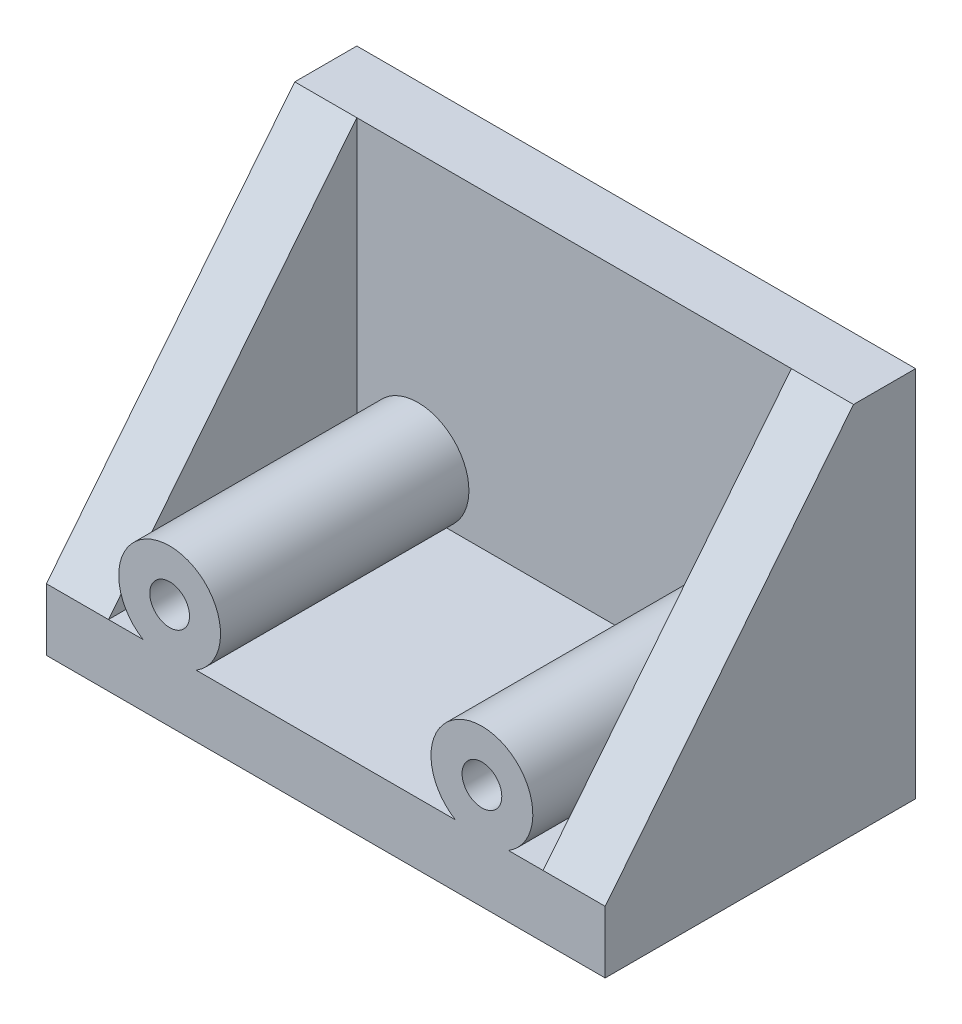
ISO-10303-21;
HEADER;
FILE_DESCRIPTION(('STEP AP214'),'2;1');
FILE_NAME('part.step','',(''),(''),'','','');
FILE_SCHEMA(('AUTOMOTIVE_DESIGN { 1 0 10303 214 1 1 1 1 }'));
ENDSEC;
DATA;
#1=APPLICATION_CONTEXT('core data for automotive mechanical design processes');
#2=APPLICATION_PROTOCOL_DEFINITION('international standard','automotive_design',2000,#1);
#3=PRODUCT_CONTEXT('',#1,'mechanical');
#4=PRODUCT('Part','Part','',(#3));
#5=PRODUCT_RELATED_PRODUCT_CATEGORY('part','',(#4));
#6=PRODUCT_DEFINITION_FORMATION('','',#4);
#7=PRODUCT_DEFINITION_CONTEXT('part definition',#1,'design');
#8=PRODUCT_DEFINITION('design','',#6,#7);
#9=PRODUCT_DEFINITION_SHAPE('','',#8);
#10=(LENGTH_UNIT() NAMED_UNIT(*) SI_UNIT(.MILLI.,.METRE.));
#11=(NAMED_UNIT(*) PLANE_ANGLE_UNIT() SI_UNIT($,.RADIAN.));
#12=(NAMED_UNIT(*) SI_UNIT($,.STERADIAN.) SOLID_ANGLE_UNIT());
#13=UNCERTAINTY_MEASURE_WITH_UNIT(LENGTH_MEASURE(1.E-05),#10,'distance_accuracy_value','');
#14=(GEOMETRIC_REPRESENTATION_CONTEXT(3) GLOBAL_UNCERTAINTY_ASSIGNED_CONTEXT((#13)) GLOBAL_UNIT_ASSIGNED_CONTEXT((#10,
#11,#12)) REPRESENTATION_CONTEXT('',''));
#15=CARTESIAN_POINT('',(0.,0.,0.));
#16=DIRECTION('',(0.,0.,1.));
#17=DIRECTION('',(1.,0.,0.));
#18=AXIS2_PLACEMENT_3D('',#15,#16,#17);
#19=CARTESIAN_POINT('',(0.,-40.,0.));
#20=DIRECTION('',(0.,1.,0.));
#21=DIRECTION('',(0.,0.,1.));
#22=AXIS2_PLACEMENT_3D('',#19,#20,#21);
#23=PLANE('',#22);
#24=DIRECTION('',(0.,0.,-1.));
#25=VECTOR('',#24,1.);
#26=CARTESIAN_POINT('',(58.837662601625,-40.,144.721359549996));
#27=LINE('',#26,#25);
#28=CARTESIAN_POINT('',(58.837662601625,-40.,100.));
#29=VERTEX_POINT('',#28);
#30=CARTESIAN_POINT('',(58.837662601625,-40.,20.));
#31=VERTEX_POINT('',#30);
#32=EDGE_CURVE('E120',#29,#31,#27,.T.);
#33=ORIENTED_EDGE('',*,*,#32,.F.);
#34=DIRECTION('',(-1.,0.,0.));
#35=VECTOR('',#34,1.);
#36=CARTESIAN_POINT('',(-90.,-40.,100.));
#37=LINE('',#36,#35);
#38=CARTESIAN_POINT('',(70.,-40.,100.));
#39=VERTEX_POINT('',#38);
#40=EDGE_CURVE('E172',#39,#29,#37,.T.);
#41=ORIENTED_EDGE('',*,*,#40,.F.);
#42=DIRECTION('',(0.,0.,-1.));
#43=VECTOR('',#42,1.);
#44=CARTESIAN_POINT('',(70.,-40.,100.));
#45=LINE('',#44,#43);
#46=CARTESIAN_POINT('',(70.,-40.,20.));
#47=VERTEX_POINT('',#46);
#48=EDGE_CURVE('E142',#39,#47,#45,.T.);
#49=ORIENTED_EDGE('',*,*,#48,.T.);
#50=DIRECTION('',(-1.,0.,0.));
#51=VECTOR('',#50,1.);
#52=CARTESIAN_POINT('',(0.,-40.,20.));
#53=LINE('',#52,#51);
#54=EDGE_CURVE('E135',#47,#31,#53,.T.);
#55=ORIENTED_EDGE('',*,*,#54,.T.);
#56=EDGE_LOOP('',(#33,#41,#49,#55));
#57=FACE_BOUND('',#56,.T.);
#58=ADVANCED_FACE('F33',(#57),#23,.T.);
#59=DIRECTION('',(0.,0.,-1.));
#60=VECTOR('',#59,1.);
#61=CARTESIAN_POINT('',(41.7543373983749,-40.,144.721359549996));
#62=LINE('',#61,#60);
#63=CARTESIAN_POINT('',(41.7543373983749,-40.,100.));
#64=VERTEX_POINT('',#63);
#65=CARTESIAN_POINT('',(41.7543373983749,-40.,20.));
#66=VERTEX_POINT('',#65);
#67=EDGE_CURVE('E48',#64,#66,#62,.T.);
#68=ORIENTED_EDGE('',*,*,#67,.T.);
#69=CARTESIAN_POINT('',(-41.7543373983749,-40.,20.));
#70=VERTEX_POINT('',#69);
#71=EDGE_CURVE('E137',#66,#70,#53,.T.);
#72=ORIENTED_EDGE('',*,*,#71,.T.);
#73=DIRECTION('',(0.,0.,-1.));
#74=VECTOR('',#73,1.);
#75=CARTESIAN_POINT('',(-41.7543373983749,-40.,144.721359549996));
#76=LINE('',#75,#74);
#77=CARTESIAN_POINT('',(-41.7543373983749,-40.,100.));
#78=VERTEX_POINT('',#77);
#79=EDGE_CURVE('E199',#78,#70,#76,.T.);
#80=ORIENTED_EDGE('',*,*,#79,.F.);
#81=EDGE_CURVE('E173',#64,#78,#37,.T.);
#82=ORIENTED_EDGE('',*,*,#81,.F.);
#83=EDGE_LOOP('',(#68,#72,#80,#82));
#84=FACE_BOUND('',#83,.T.);
#85=ADVANCED_FACE('F231',(#84),#23,.T.);
#86=CARTESIAN_POINT('',(-58.837662601625,-40.,100.));
#87=VERTEX_POINT('',#86);
#88=CARTESIAN_POINT('',(-70.,-40.,100.));
#89=VERTEX_POINT('',#88);
#90=EDGE_CURVE('E168',#87,#89,#37,.T.);
#91=ORIENTED_EDGE('',*,*,#90,.F.);
#92=DIRECTION('',(0.,0.,-1.));
#93=VECTOR('',#92,1.);
#94=CARTESIAN_POINT('',(-58.837662601625,-40.,144.721359549996));
#95=LINE('',#94,#93);
#96=CARTESIAN_POINT('',(-58.837662601625,-40.,20.));
#97=VERTEX_POINT('',#96);
#98=EDGE_CURVE('E189',#87,#97,#95,.T.);
#99=ORIENTED_EDGE('',*,*,#98,.T.);
#100=CARTESIAN_POINT('',(-70.,-40.,20.));
#101=VERTEX_POINT('',#100);
#102=EDGE_CURVE('E145',#97,#101,#53,.T.);
#103=ORIENTED_EDGE('',*,*,#102,.T.);
#104=DIRECTION('',(0.,0.,-1.));
#105=VECTOR('',#104,1.);
#106=CARTESIAN_POINT('',(-70.,-40.,100.));
#107=LINE('',#106,#105);
#108=EDGE_CURVE('E184',#89,#101,#107,.T.);
#109=ORIENTED_EDGE('',*,*,#108,.F.);
#110=EDGE_LOOP('',(#91,#99,#103,#109));
#111=FACE_BOUND('',#110,.T.);
#112=ADVANCED_FACE('F229',(#111),#23,.T.);
#113=CARTESIAN_POINT('',(0.,0.,20.));
#114=DIRECTION('',(0.,0.,1.));
#115=DIRECTION('',(1.,0.,0.));
#116=AXIS2_PLACEMENT_3D('',#113,#114,#115);
#117=PLANE('',#116);
#118=CARTESIAN_POINT('',(50.296,-26.,20.));
#119=DIRECTION('',(0.,0.,-1.));
#120=DIRECTION('',(-1.,0.,0.));
#121=AXIS2_PLACEMENT_3D('',#118,#119,#120);
#122=CIRCLE('',#121,16.4);
#123=EDGE_CURVE('E123',#66,#31,#122,.T.);
#124=ORIENTED_EDGE('',*,*,#123,.T.);
#125=ORIENTED_EDGE('',*,*,#54,.F.);
#126=DIRECTION('',(0.,1.,0.));
#127=VECTOR('',#126,1.);
#128=CARTESIAN_POINT('',(70.,-40.,20.));
#129=LINE('',#128,#127);
#130=CARTESIAN_POINT('',(70.,60.,20.));
#131=VERTEX_POINT('',#130);
#132=EDGE_CURVE('E169',#47,#131,#129,.T.);
#133=ORIENTED_EDGE('',*,*,#132,.T.);
#134=DIRECTION('',(-1.,0.,0.));
#135=VECTOR('',#134,1.);
#136=CARTESIAN_POINT('',(-90.,60.,20.));
#137=LINE('',#136,#135);
#138=CARTESIAN_POINT('',(-70.,60.,20.));
#139=VERTEX_POINT('',#138);
#140=EDGE_CURVE('E257',#131,#139,#137,.T.);
#141=ORIENTED_EDGE('',*,*,#140,.T.);
#142=DIRECTION('',(0.,1.,0.));
#143=VECTOR('',#142,1.);
#144=CARTESIAN_POINT('',(-70.,-40.,20.));
#145=LINE('',#144,#143);
#146=EDGE_CURVE('E191',#101,#139,#145,.T.);
#147=ORIENTED_EDGE('',*,*,#146,.F.);
#148=ORIENTED_EDGE('',*,*,#102,.F.);
#149=CARTESIAN_POINT('',(-50.296,-26.,20.));
#150=DIRECTION('',(0.,0.,1.));
#151=DIRECTION('',(1.,0.,0.));
#152=AXIS2_PLACEMENT_3D('',#149,#150,#151);
#153=CIRCLE('',#152,16.4);
#154=EDGE_CURVE('E202',#70,#97,#153,.T.);
#155=ORIENTED_EDGE('',*,*,#154,.F.);
#156=ORIENTED_EDGE('',*,*,#71,.F.);
#157=EDGE_LOOP('',(#124,#125,#133,#141,#147,#148,#155,#156));
#158=FACE_BOUND('',#157,.T.);
#159=ADVANCED_FACE('F133',(#158),#117,.T.);
#160=CARTESIAN_POINT('',(90.,60.,20.));
#161=DIRECTION('',(-1.,0.,0.));
#162=DIRECTION('',(0.,0.,1.));
#163=AXIS2_PLACEMENT_3D('',#160,#161,#162);
#164=PLANE('',#163);
#165=DIRECTION('',(0.,0.,-1.));
#166=VECTOR('',#165,1.);
#167=CARTESIAN_POINT('',(90.,60.,20.));
#168=LINE('',#167,#166);
#169=CARTESIAN_POINT('',(90.,60.,20.));
#170=VERTEX_POINT('',#169);
#171=CARTESIAN_POINT('',(90.,60.,0.));
#172=VERTEX_POINT('',#171);
#173=EDGE_CURVE('E41',#170,#172,#168,.T.);
#174=ORIENTED_EDGE('',*,*,#173,.F.);
#175=DIRECTION('',(0.,-0.78086880944303,0.624695047554424));
#176=VECTOR('',#175,1.);
#177=CARTESIAN_POINT('',(90.,60.,20.));
#178=LINE('',#177,#176);
#179=CARTESIAN_POINT('',(90.,-40.,100.));
#180=VERTEX_POINT('',#179);
#181=EDGE_CURVE('E174',#170,#180,#178,.T.);
#182=ORIENTED_EDGE('',*,*,#181,.T.);
#183=DIRECTION('',(0.,-1.,0.));
#184=VECTOR('',#183,1.);
#185=CARTESIAN_POINT('',(90.,-40.,100.));
#186=LINE('',#185,#184);
#187=CARTESIAN_POINT('',(90.,-60.,100.));
#188=VERTEX_POINT('',#187);
#189=EDGE_CURVE('E157',#180,#188,#186,.T.);
#190=ORIENTED_EDGE('',*,*,#189,.T.);
#191=DIRECTION('',(0.,0.,-1.));
#192=VECTOR('',#191,1.);
#193=CARTESIAN_POINT('',(90.,-60.,20.));
#194=LINE('',#193,#192);
#195=CARTESIAN_POINT('',(90.,-60.,0.));
#196=VERTEX_POINT('',#195);
#197=EDGE_CURVE('E265',#188,#196,#194,.T.);
#198=ORIENTED_EDGE('',*,*,#197,.T.);
#199=DIRECTION('',(0.,1.,0.));
#200=VECTOR('',#199,1.);
#201=CARTESIAN_POINT('',(90.,60.,0.));
#202=LINE('',#201,#200);
#203=EDGE_CURVE('E143',#196,#172,#202,.T.);
#204=ORIENTED_EDGE('',*,*,#203,.T.);
#205=EDGE_LOOP('',(#174,#182,#190,#198,#204));
#206=FACE_BOUND('',#205,.T.);
#207=ADVANCED_FACE('F35',(#206),#164,.F.);
#208=CARTESIAN_POINT('',(-90.,60.,20.));
#209=DIRECTION('',(0.,-1.,0.));
#210=DIRECTION('',(0.,0.,-1.));
#211=AXIS2_PLACEMENT_3D('',#208,#209,#210);
#212=PLANE('',#211);
#213=DIRECTION('',(-1.,0.,0.));
#214=VECTOR('',#213,1.);
#215=CARTESIAN_POINT('',(-90.,60.,0.));
#216=LINE('',#215,#214);
#217=CARTESIAN_POINT('',(-90.,60.,0.));
#218=VERTEX_POINT('',#217);
#219=EDGE_CURVE('E146',#172,#218,#216,.T.);
#220=ORIENTED_EDGE('',*,*,#219,.T.);
#221=DIRECTION('',(0.,0.,-1.));
#222=VECTOR('',#221,1.);
#223=CARTESIAN_POINT('',(-90.,60.,20.));
#224=LINE('',#223,#222);
#225=CARTESIAN_POINT('',(-90.,60.,20.));
#226=VERTEX_POINT('',#225);
#227=EDGE_CURVE('E276',#226,#218,#224,.T.);
#228=ORIENTED_EDGE('',*,*,#227,.F.);
#229=DIRECTION('',(-1.,0.,0.));
#230=VECTOR('',#229,1.);
#231=CARTESIAN_POINT('',(-70.,60.,20.));
#232=LINE('',#231,#230);
#233=EDGE_CURVE('E182',#139,#226,#232,.T.);
#234=ORIENTED_EDGE('',*,*,#233,.F.);
#235=ORIENTED_EDGE('',*,*,#140,.F.);
#236=EDGE_CURVE('E251',#170,#131,#137,.T.);
#237=ORIENTED_EDGE('',*,*,#236,.F.);
#238=ORIENTED_EDGE('',*,*,#173,.T.);
#239=EDGE_LOOP('',(#220,#228,#234,#235,#237,#238));
#240=FACE_BOUND('',#239,.T.);
#241=ADVANCED_FACE('F260',(#240),#212,.F.);
#242=CARTESIAN_POINT('',(-90.,60.,20.));
#243=DIRECTION('',(1.,0.,0.));
#244=DIRECTION('',(0.,1.,0.));
#245=AXIS2_PLACEMENT_3D('',#242,#243,#244);
#246=PLANE('',#245);
#247=DIRECTION('',(0.,-1.,0.));
#248=VECTOR('',#247,1.);
#249=CARTESIAN_POINT('',(-90.,60.,0.));
#250=LINE('',#249,#248);
#251=CARTESIAN_POINT('',(-90.,-60.,0.));
#252=VERTEX_POINT('',#251);
#253=EDGE_CURVE('E266',#218,#252,#250,.T.);
#254=ORIENTED_EDGE('',*,*,#253,.T.);
#255=DIRECTION('',(0.,0.,-1.));
#256=VECTOR('',#255,1.);
#257=CARTESIAN_POINT('',(-90.,-60.,20.));
#258=LINE('',#257,#256);
#259=CARTESIAN_POINT('',(-90.,-60.,100.));
#260=VERTEX_POINT('',#259);
#261=EDGE_CURVE('E273',#260,#252,#258,.T.);
#262=ORIENTED_EDGE('',*,*,#261,.F.);
#263=DIRECTION('',(0.,-1.,0.));
#264=VECTOR('',#263,1.);
#265=CARTESIAN_POINT('',(-90.,-40.,100.));
#266=LINE('',#265,#264);
#267=CARTESIAN_POINT('',(-90.,-40.,100.));
#268=VERTEX_POINT('',#267);
#269=EDGE_CURVE('E150',#268,#260,#266,.T.);
#270=ORIENTED_EDGE('',*,*,#269,.F.);
#271=DIRECTION('',(0.,-0.78086880944303,0.624695047554424));
#272=VECTOR('',#271,1.);
#273=CARTESIAN_POINT('',(-90.,60.,20.));
#274=LINE('',#273,#272);
#275=EDGE_CURVE('E186',#226,#268,#274,.T.);
#276=ORIENTED_EDGE('',*,*,#275,.F.);
#277=ORIENTED_EDGE('',*,*,#227,.T.);
#278=EDGE_LOOP('',(#254,#262,#270,#276,#277));
#279=FACE_BOUND('',#278,.T.);
#280=ADVANCED_FACE('F286',(#279),#246,.F.);
#281=CARTESIAN_POINT('',(-90.,-60.,20.));
#282=DIRECTION('',(0.,1.,0.));
#283=DIRECTION('',(0.,0.,1.));
#284=AXIS2_PLACEMENT_3D('',#281,#282,#283);
#285=PLANE('',#284);
#286=DIRECTION('',(1.,0.,0.));
#287=VECTOR('',#286,1.);
#288=CARTESIAN_POINT('',(-90.,-60.,0.));
#289=LINE('',#288,#287);
#290=EDGE_CURVE('E264',#252,#196,#289,.T.);
#291=ORIENTED_EDGE('',*,*,#290,.T.);
#292=ORIENTED_EDGE('',*,*,#197,.F.);
#293=DIRECTION('',(-1.,0.,0.));
#294=VECTOR('',#293,1.);
#295=CARTESIAN_POINT('',(-90.,-60.,100.));
#296=LINE('',#295,#294);
#297=EDGE_CURVE('E166',#188,#260,#296,.T.);
#298=ORIENTED_EDGE('',*,*,#297,.T.);
#299=ORIENTED_EDGE('',*,*,#261,.T.);
#300=EDGE_LOOP('',(#291,#292,#298,#299));
#301=FACE_BOUND('',#300,.T.);
#302=ADVANCED_FACE('F289',(#301),#285,.F.);
#303=CARTESIAN_POINT('',(0.,0.,0.));
#304=DIRECTION('',(0.,0.,1.));
#305=DIRECTION('',(1.,0.,0.));
#306=AXIS2_PLACEMENT_3D('',#303,#304,#305);
#307=PLANE('',#306);
#308=ORIENTED_EDGE('',*,*,#219,.F.);
#309=ORIENTED_EDGE('',*,*,#203,.F.);
#310=ORIENTED_EDGE('',*,*,#290,.F.);
#311=ORIENTED_EDGE('',*,*,#253,.F.);
#312=EDGE_LOOP('',(#308,#309,#310,#311));
#313=FACE_BOUND('',#312,.T.);
#314=ADVANCED_FACE('F284',(#313),#307,.F.);
#315=CARTESIAN_POINT('',(-90.,-40.,100.));
#316=DIRECTION('',(0.,0.,1.));
#317=DIRECTION('',(1.,0.,0.));
#318=AXIS2_PLACEMENT_3D('',#315,#316,#317);
#319=PLANE('',#318);
#320=ORIENTED_EDGE('',*,*,#297,.F.);
#321=ORIENTED_EDGE('',*,*,#189,.F.);
#322=EDGE_CURVE('E164',#180,#39,#37,.T.);
#323=ORIENTED_EDGE('',*,*,#322,.T.);
#324=ORIENTED_EDGE('',*,*,#40,.T.);
#325=CARTESIAN_POINT('',(50.296,-26.,100.));
#326=DIRECTION('',(0.,0.,1.));
#327=DIRECTION('',(1.,0.,0.));
#328=AXIS2_PLACEMENT_3D('',#325,#326,#327);
#329=CIRCLE('',#328,16.4);
#330=EDGE_CURVE('E124',#64,#29,#329,.F.);
#331=ORIENTED_EDGE('',*,*,#330,.F.);
#332=ORIENTED_EDGE('',*,*,#81,.T.);
#333=CARTESIAN_POINT('',(-50.296,-26.,100.));
#334=DIRECTION('',(0.,0.,1.));
#335=DIRECTION('',(1.,0.,0.));
#336=AXIS2_PLACEMENT_3D('',#333,#334,#335);
#337=CIRCLE('',#336,16.4);
#338=EDGE_CURVE('E56',#78,#87,#337,.T.);
#339=ORIENTED_EDGE('',*,*,#338,.T.);
#340=ORIENTED_EDGE('',*,*,#90,.T.);
#341=DIRECTION('',(-1.,0.,0.));
#342=VECTOR('',#341,1.);
#343=CARTESIAN_POINT('',(-70.,-40.,100.));
#344=LINE('',#343,#342);
#345=EDGE_CURVE('E177',#89,#268,#344,.T.);
#346=ORIENTED_EDGE('',*,*,#345,.T.);
#347=ORIENTED_EDGE('',*,*,#269,.T.);
#348=EDGE_LOOP('',(#320,#321,#323,#324,#331,#332,#339,#340,#346,#347));
#349=FACE_BOUND('',#348,.T.);
#350=CARTESIAN_POINT('',(-50.296,-26.,100.));
#351=DIRECTION('',(0.,0.,1.));
#352=DIRECTION('',(1.,0.,0.));
#353=AXIS2_PLACEMENT_3D('',#350,#351,#352);
#354=CIRCLE('',#353,6.40000000000001);
#355=CARTESIAN_POINT('',(-43.896,-26.,100.));
#356=VERTEX_POINT('',#355);
#357=EDGE_CURVE('E195',#356,#356,#354,.T.);
#358=ORIENTED_EDGE('',*,*,#357,.F.);
#359=EDGE_LOOP('',(#358));
#360=FACE_BOUND('',#359,.T.);
#361=CARTESIAN_POINT('',(50.296,-26.,100.));
#362=DIRECTION('',(0.,0.,1.));
#363=DIRECTION('',(1.,0.,0.));
#364=AXIS2_PLACEMENT_3D('',#361,#362,#363);
#365=CIRCLE('',#364,6.40000000000001);
#366=CARTESIAN_POINT('',(56.696,-26.,100.));
#367=VERTEX_POINT('',#366);
#368=EDGE_CURVE('E138',#367,#367,#365,.F.);
#369=ORIENTED_EDGE('',*,*,#368,.T.);
#370=EDGE_LOOP('',(#369));
#371=FACE_BOUND('',#370,.T.);
#372=ADVANCED_FACE('F242',(#349,#360,#371),#319,.T.);
#373=CARTESIAN_POINT('',(70.,60.,20.));
#374=DIRECTION('',(0.,0.624695047554424,0.78086880944303));
#375=DIRECTION('',(0.,-0.78086880944303,0.624695047554424));
#376=AXIS2_PLACEMENT_3D('',#373,#374,#375);
#377=PLANE('',#376);
#378=ORIENTED_EDGE('',*,*,#181,.F.);
#379=ORIENTED_EDGE('',*,*,#236,.T.);
#380=DIRECTION('',(0.,-0.78086880944303,0.624695047554424));
#381=VECTOR('',#380,1.);
#382=CARTESIAN_POINT('',(70.,60.,20.));
#383=LINE('',#382,#381);
#384=EDGE_CURVE('E176',#131,#39,#383,.T.);
#385=ORIENTED_EDGE('',*,*,#384,.T.);
#386=ORIENTED_EDGE('',*,*,#322,.F.);
#387=EDGE_LOOP('',(#378,#379,#385,#386));
#388=FACE_BOUND('',#387,.T.);
#389=ADVANCED_FACE('F248',(#388),#377,.T.);
#390=CARTESIAN_POINT('',(70.,0.,0.));
#391=DIRECTION('',(1.,0.,0.));
#392=DIRECTION('',(0.,1.,0.));
#393=AXIS2_PLACEMENT_3D('',#390,#391,#392);
#394=PLANE('',#393);
#395=ORIENTED_EDGE('',*,*,#384,.F.);
#396=ORIENTED_EDGE('',*,*,#132,.F.);
#397=ORIENTED_EDGE('',*,*,#48,.F.);
#398=EDGE_LOOP('',(#395,#396,#397));
#399=FACE_BOUND('',#398,.T.);
#400=ADVANCED_FACE('F253',(#399),#394,.F.);
#401=CARTESIAN_POINT('',(-70.,60.,20.));
#402=DIRECTION('',(0.,-0.624695047554424,-0.78086880944303));
#403=DIRECTION('',(0.,0.78086880944303,-0.624695047554424));
#404=AXIS2_PLACEMENT_3D('',#401,#402,#403);
#405=PLANE('',#404);
#406=ORIENTED_EDGE('',*,*,#275,.T.);
#407=ORIENTED_EDGE('',*,*,#345,.F.);
#408=DIRECTION('',(0.,-0.78086880944303,0.624695047554424));
#409=VECTOR('',#408,1.);
#410=CARTESIAN_POINT('',(-70.,60.,20.));
#411=LINE('',#410,#409);
#412=EDGE_CURVE('E188',#139,#89,#411,.T.);
#413=ORIENTED_EDGE('',*,*,#412,.F.);
#414=ORIENTED_EDGE('',*,*,#233,.T.);
#415=EDGE_LOOP('',(#406,#407,#413,#414));
#416=FACE_BOUND('',#415,.T.);
#417=ADVANCED_FACE('F384',(#416),#405,.F.);
#418=CARTESIAN_POINT('',(-70.,0.,0.));
#419=DIRECTION('',(-1.,0.,0.));
#420=DIRECTION('',(0.,1.,0.));
#421=AXIS2_PLACEMENT_3D('',#418,#419,#420);
#422=PLANE('',#421);
#423=ORIENTED_EDGE('',*,*,#412,.T.);
#424=ORIENTED_EDGE('',*,*,#108,.T.);
#425=ORIENTED_EDGE('',*,*,#146,.T.);
#426=EDGE_LOOP('',(#423,#424,#425));
#427=FACE_BOUND('',#426,.T.);
#428=ADVANCED_FACE('F369',(#427),#422,.F.);
#429=CARTESIAN_POINT('',(-50.296,-26.,144.721359549996));
#430=DIRECTION('',(0.,0.,-1.));
#431=DIRECTION('',(-1.,0.,0.));
#432=AXIS2_PLACEMENT_3D('',#429,#430,#431);
#433=CYLINDRICAL_SURFACE('',#432,16.4);
#434=ORIENTED_EDGE('',*,*,#338,.F.);
#435=ORIENTED_EDGE('',*,*,#79,.T.);
#436=ORIENTED_EDGE('',*,*,#154,.T.);
#437=ORIENTED_EDGE('',*,*,#98,.F.);
#438=EDGE_LOOP('',(#434,#435,#436,#437));
#439=FACE_BOUND('',#438,.T.);
#440=ADVANCED_FACE('F363',(#439),#433,.T.);
#441=CARTESIAN_POINT('',(-50.296,-26.,144.721359549996));
#442=DIRECTION('',(0.,0.,-1.));
#443=DIRECTION('',(-1.,0.,0.));
#444=AXIS2_PLACEMENT_3D('',#441,#442,#443);
#445=CYLINDRICAL_SURFACE('',#444,6.40000000000001);
#446=CARTESIAN_POINT('',(-50.296,-26.,20.));
#447=DIRECTION('',(0.,0.,1.));
#448=DIRECTION('',(1.,0.,0.));
#449=AXIS2_PLACEMENT_3D('',#446,#447,#448);
#450=CIRCLE('',#449,6.40000000000001);
#451=CARTESIAN_POINT('',(-43.896,-26.,20.));
#452=VERTEX_POINT('',#451);
#453=EDGE_CURVE('E11',#452,#452,#450,.F.);
#454=ORIENTED_EDGE('',*,*,#453,.T.);
#455=EDGE_LOOP('',(#454));
#456=FACE_BOUND('',#455,.T.);
#457=ORIENTED_EDGE('',*,*,#357,.T.);
#458=EDGE_LOOP('',(#457));
#459=FACE_BOUND('',#458,.T.);
#460=ADVANCED_FACE('F226',(#456,#459),#445,.F.);
#461=ORIENTED_EDGE('',*,*,#453,.F.);
#462=EDGE_LOOP('',(#461));
#463=FACE_BOUND('',#462,.T.);
#464=ADVANCED_FACE('F218',(#463),#117,.T.);
#465=CARTESIAN_POINT('',(50.296,-26.,144.721359549996));
#466=DIRECTION('',(0.,0.,-1.));
#467=DIRECTION('',(-1.,0.,0.));
#468=AXIS2_PLACEMENT_3D('',#465,#466,#467);
#469=CYLINDRICAL_SURFACE('',#468,16.4);
#470=ORIENTED_EDGE('',*,*,#67,.F.);
#471=ORIENTED_EDGE('',*,*,#330,.T.);
#472=ORIENTED_EDGE('',*,*,#32,.T.);
#473=ORIENTED_EDGE('',*,*,#123,.F.);
#474=EDGE_LOOP('',(#470,#471,#472,#473));
#475=FACE_BOUND('',#474,.T.);
#476=ADVANCED_FACE('F122',(#475),#469,.T.);
#477=CARTESIAN_POINT('',(50.296,-26.,144.721359549996));
#478=DIRECTION('',(0.,0.,-1.));
#479=DIRECTION('',(-1.,0.,0.));
#480=AXIS2_PLACEMENT_3D('',#477,#478,#479);
#481=CYLINDRICAL_SURFACE('',#480,6.40000000000001);
#482=CARTESIAN_POINT('',(50.296,-26.,20.));
#483=DIRECTION('',(0.,0.,-1.));
#484=DIRECTION('',(-1.,0.,0.));
#485=AXIS2_PLACEMENT_3D('',#482,#483,#484);
#486=CIRCLE('',#485,6.40000000000001);
#487=CARTESIAN_POINT('',(43.896,-26.,20.));
#488=VERTEX_POINT('',#487);
#489=EDGE_CURVE('E139',#488,#488,#486,.T.);
#490=ORIENTED_EDGE('',*,*,#489,.T.);
#491=EDGE_LOOP('',(#490));
#492=FACE_BOUND('',#491,.T.);
#493=ORIENTED_EDGE('',*,*,#368,.F.);
#494=EDGE_LOOP('',(#493));
#495=FACE_BOUND('',#494,.T.);
#496=ADVANCED_FACE('F212',(#492,#495),#481,.F.);
#497=ORIENTED_EDGE('',*,*,#489,.F.);
#498=EDGE_LOOP('',(#497));
#499=FACE_BOUND('',#498,.T.);
#500=ADVANCED_FACE('F215',(#499),#117,.T.);
#501=CLOSED_SHELL('',(#58,#85,#112,#159,#207,#241,#280,#302,#314,#372,#389,#400,#417,#428,#440,
#460,#464,#476,#496,#500));
#502=MANIFOLD_SOLID_BREP('B2',#501);
#503=ADVANCED_BREP_SHAPE_REPRESENTATION('',(#18,#502),#14);
#504=SHAPE_DEFINITION_REPRESENTATION(#9,#503);
ENDSEC;
END-ISO-10303-21;
